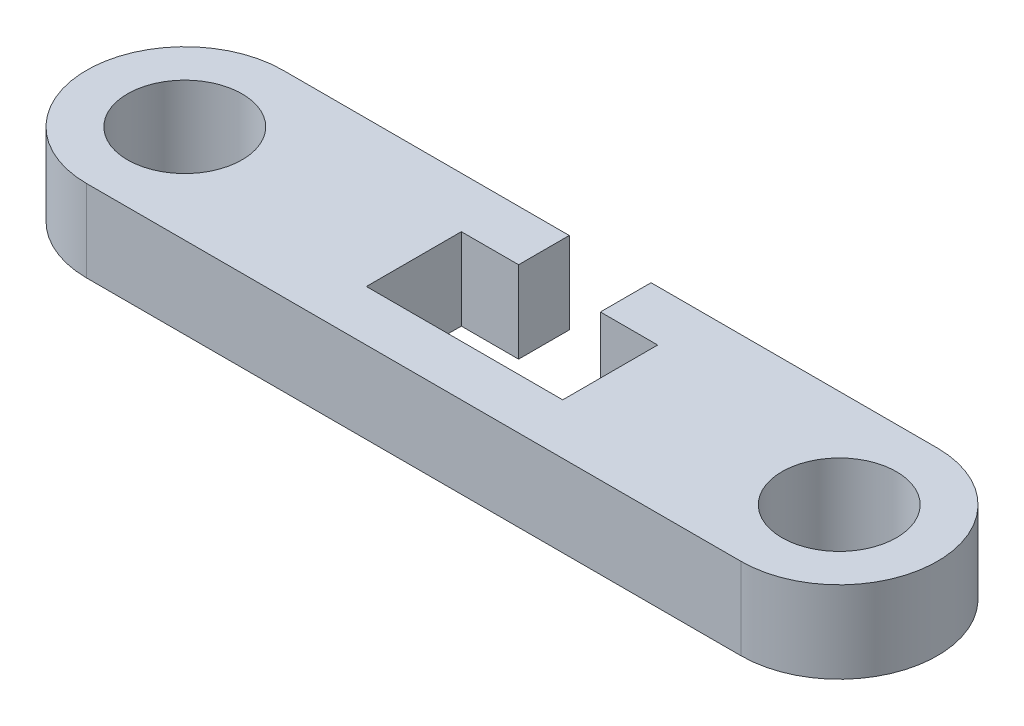
ISO-10303-21;
HEADER;
FILE_DESCRIPTION(('STEP AP214'),'2;1');
FILE_NAME('part.step','',(''),(''),'','','');
FILE_SCHEMA(('AUTOMOTIVE_DESIGN { 1 0 10303 214 1 1 1 1 }'));
ENDSEC;
DATA;
#1=APPLICATION_CONTEXT('core data for automotive mechanical design processes');
#2=APPLICATION_PROTOCOL_DEFINITION('international standard','automotive_design',2000,#1);
#3=PRODUCT_CONTEXT('',#1,'mechanical');
#4=PRODUCT('Part','Part','',(#3));
#5=PRODUCT_RELATED_PRODUCT_CATEGORY('part','',(#4));
#6=PRODUCT_DEFINITION_FORMATION('','',#4);
#7=PRODUCT_DEFINITION_CONTEXT('part definition',#1,'design');
#8=PRODUCT_DEFINITION('design','',#6,#7);
#9=PRODUCT_DEFINITION_SHAPE('','',#8);
#10=(LENGTH_UNIT() NAMED_UNIT(*) SI_UNIT(.MILLI.,.METRE.));
#11=(NAMED_UNIT(*) PLANE_ANGLE_UNIT() SI_UNIT($,.RADIAN.));
#12=(NAMED_UNIT(*) SI_UNIT($,.STERADIAN.) SOLID_ANGLE_UNIT());
#13=UNCERTAINTY_MEASURE_WITH_UNIT(LENGTH_MEASURE(1.E-05),#10,'distance_accuracy_value','');
#14=(GEOMETRIC_REPRESENTATION_CONTEXT(3) GLOBAL_UNCERTAINTY_ASSIGNED_CONTEXT((#13)) GLOBAL_UNIT_ASSIGNED_CONTEXT((#10,
#11,#12)) REPRESENTATION_CONTEXT('',''));
#15=CARTESIAN_POINT('',(0.,0.,0.));
#16=DIRECTION('',(0.,0.,1.));
#17=DIRECTION('',(1.,0.,0.));
#18=AXIS2_PLACEMENT_3D('',#15,#16,#17);
#19=CARTESIAN_POINT('',(4.75,2.5,0.));
#20=DIRECTION('',(1.,0.,0.));
#21=DIRECTION('',(0.,0.,-1.));
#22=AXIS2_PLACEMENT_3D('',#19,#20,#21);
#23=PLANE('',#22);
#24=DIRECTION('',(0.,0.,1.));
#25=VECTOR('',#24,1.);
#26=CARTESIAN_POINT('',(4.75,0.,0.));
#27=LINE('',#26,#25);
#28=CARTESIAN_POINT('',(4.75,0.,-5.));
#29=VERTEX_POINT('',#28);
#30=CARTESIAN_POINT('',(4.75,0.,-3.45180722891566));
#31=VERTEX_POINT('',#30);
#32=EDGE_CURVE('E187',#29,#31,#27,.T.);
#33=ORIENTED_EDGE('',*,*,#32,.T.);
#34=DIRECTION('',(0.,-1.,0.));
#35=VECTOR('',#34,1.);
#36=CARTESIAN_POINT('',(4.75,2.5,-3.45180722891566));
#37=LINE('',#36,#35);
#38=CARTESIAN_POINT('',(4.75,2.5,-3.45180722891566));
#39=VERTEX_POINT('',#38);
#40=EDGE_CURVE('E11',#39,#31,#37,.T.);
#41=ORIENTED_EDGE('',*,*,#40,.F.);
#42=DIRECTION('',(0.,0.,1.));
#43=VECTOR('',#42,1.);
#44=CARTESIAN_POINT('',(4.75,2.5,0.));
#45=LINE('',#44,#43);
#46=CARTESIAN_POINT('',(4.75,2.5,-5.));
#47=VERTEX_POINT('',#46);
#48=EDGE_CURVE('E232',#47,#39,#45,.T.);
#49=ORIENTED_EDGE('',*,*,#48,.F.);
#50=DIRECTION('',(0.,-1.,0.));
#51=VECTOR('',#50,1.);
#52=CARTESIAN_POINT('',(4.75,2.5,-5.));
#53=LINE('',#52,#51);
#54=EDGE_CURVE('E186',#47,#29,#53,.T.);
#55=ORIENTED_EDGE('',*,*,#54,.T.);
#56=EDGE_LOOP('',(#33,#41,#49,#55));
#57=FACE_BOUND('',#56,.T.);
#58=ADVANCED_FACE('F49',(#57),#23,.F.);
#59=CARTESIAN_POINT('',(0.,2.5,-3.45180722891566));
#60=DIRECTION('',(0.,0.,-1.));
#61=DIRECTION('',(-1.,0.,0.));
#62=AXIS2_PLACEMENT_3D('',#59,#60,#61);
#63=PLANE('',#62);
#64=DIRECTION('',(1.,0.,0.));
#65=VECTOR('',#64,1.);
#66=CARTESIAN_POINT('',(0.,0.,-3.45180722891566));
#67=LINE('',#66,#65);
#68=CARTESIAN_POINT('',(6.5,0.,-3.45180722891566));
#69=VERTEX_POINT('',#68);
#70=EDGE_CURVE('E191',#31,#69,#67,.T.);
#71=ORIENTED_EDGE('',*,*,#70,.T.);
#72=DIRECTION('',(0.,-1.,0.));
#73=VECTOR('',#72,1.);
#74=CARTESIAN_POINT('',(6.5,2.5,-3.45180722891566));
#75=LINE('',#74,#73);
#76=CARTESIAN_POINT('',(6.5,2.5,-3.45180722891566));
#77=VERTEX_POINT('',#76);
#78=EDGE_CURVE('E58',#77,#69,#75,.T.);
#79=ORIENTED_EDGE('',*,*,#78,.F.);
#80=DIRECTION('',(1.,0.,0.));
#81=VECTOR('',#80,1.);
#82=CARTESIAN_POINT('',(0.,2.5,-3.45180722891566));
#83=LINE('',#82,#81);
#84=EDGE_CURVE('E121',#39,#77,#83,.T.);
#85=ORIENTED_EDGE('',*,*,#84,.F.);
#86=ORIENTED_EDGE('',*,*,#40,.T.);
#87=EDGE_LOOP('',(#71,#79,#85,#86));
#88=FACE_BOUND('',#87,.T.);
#89=ADVANCED_FACE('F347',(#88),#63,.F.);
#90=CARTESIAN_POINT('',(6.5,2.5,0.));
#91=DIRECTION('',(1.,0.,0.));
#92=DIRECTION('',(0.,0.,-1.));
#93=AXIS2_PLACEMENT_3D('',#90,#91,#92);
#94=PLANE('',#93);
#95=DIRECTION('',(0.,0.,1.));
#96=VECTOR('',#95,1.);
#97=CARTESIAN_POINT('',(6.5,0.,0.));
#98=LINE('',#97,#96);
#99=CARTESIAN_POINT('',(6.5,0.,-0.55));
#100=VERTEX_POINT('',#99);
#101=EDGE_CURVE('E194',#69,#100,#98,.T.);
#102=ORIENTED_EDGE('',*,*,#101,.T.);
#103=DIRECTION('',(0.,-1.,0.));
#104=VECTOR('',#103,1.);
#105=CARTESIAN_POINT('',(6.5,2.5,-0.55));
#106=LINE('',#105,#104);
#107=CARTESIAN_POINT('',(6.5,2.5,-0.55));
#108=VERTEX_POINT('',#107);
#109=EDGE_CURVE('E255',#108,#100,#106,.T.);
#110=ORIENTED_EDGE('',*,*,#109,.F.);
#111=DIRECTION('',(0.,0.,1.));
#112=VECTOR('',#111,1.);
#113=CARTESIAN_POINT('',(6.5,2.5,0.));
#114=LINE('',#113,#112);
#115=EDGE_CURVE('E267',#77,#108,#114,.T.);
#116=ORIENTED_EDGE('',*,*,#115,.F.);
#117=ORIENTED_EDGE('',*,*,#78,.T.);
#118=EDGE_LOOP('',(#102,#110,#116,#117));
#119=FACE_BOUND('',#118,.T.);
#120=ADVANCED_FACE('F265',(#119),#94,.F.);
#121=CARTESIAN_POINT('',(0.,2.5,-0.549999999999999));
#122=DIRECTION('',(0.,0.,1.));
#123=DIRECTION('',(1.,0.,0.));
#124=AXIS2_PLACEMENT_3D('',#121,#122,#123);
#125=PLANE('',#124);
#126=DIRECTION('',(-1.,0.,0.));
#127=VECTOR('',#126,1.);
#128=CARTESIAN_POINT('',(0.,0.,-0.549999999999999));
#129=LINE('',#128,#127);
#130=CARTESIAN_POINT('',(0.5,0.,-0.549999999999999));
#131=VERTEX_POINT('',#130);
#132=EDGE_CURVE('E197',#100,#131,#129,.T.);
#133=ORIENTED_EDGE('',*,*,#132,.T.);
#134=DIRECTION('',(0.,-1.,0.));
#135=VECTOR('',#134,1.);
#136=CARTESIAN_POINT('',(0.5,2.5,-0.549999999999999));
#137=LINE('',#136,#135);
#138=CARTESIAN_POINT('',(0.5,2.5,-0.549999999999999));
#139=VERTEX_POINT('',#138);
#140=EDGE_CURVE('E251',#139,#131,#137,.T.);
#141=ORIENTED_EDGE('',*,*,#140,.F.);
#142=DIRECTION('',(-1.,0.,0.));
#143=VECTOR('',#142,1.);
#144=CARTESIAN_POINT('',(0.,2.5,-0.549999999999999));
#145=LINE('',#144,#143);
#146=EDGE_CURVE('E286',#108,#139,#145,.T.);
#147=ORIENTED_EDGE('',*,*,#146,.F.);
#148=ORIENTED_EDGE('',*,*,#109,.T.);
#149=EDGE_LOOP('',(#133,#141,#147,#148));
#150=FACE_BOUND('',#149,.T.);
#151=ADVANCED_FACE('F277',(#150),#125,.F.);
#152=CARTESIAN_POINT('',(0.5,2.5,0.));
#153=DIRECTION('',(-1.,0.,0.));
#154=DIRECTION('',(0.,0.,1.));
#155=AXIS2_PLACEMENT_3D('',#152,#153,#154);
#156=PLANE('',#155);
#157=DIRECTION('',(0.,0.,-1.));
#158=VECTOR('',#157,1.);
#159=CARTESIAN_POINT('',(0.5,0.,0.));
#160=LINE('',#159,#158);
#161=CARTESIAN_POINT('',(0.5,0.,-3.45180722891568));
#162=VERTEX_POINT('',#161);
#163=EDGE_CURVE('E200',#131,#162,#160,.T.);
#164=ORIENTED_EDGE('',*,*,#163,.T.);
#165=DIRECTION('',(0.,-1.,0.));
#166=VECTOR('',#165,1.);
#167=CARTESIAN_POINT('',(0.5,2.5,-3.45180722891568));
#168=LINE('',#167,#166);
#169=CARTESIAN_POINT('',(0.5,2.5,-3.45180722891568));
#170=VERTEX_POINT('',#169);
#171=EDGE_CURVE('E248',#170,#162,#168,.T.);
#172=ORIENTED_EDGE('',*,*,#171,.F.);
#173=DIRECTION('',(0.,0.,-1.));
#174=VECTOR('',#173,1.);
#175=CARTESIAN_POINT('',(0.5,2.5,0.));
#176=LINE('',#175,#174);
#177=EDGE_CURVE('E283',#139,#170,#176,.T.);
#178=ORIENTED_EDGE('',*,*,#177,.F.);
#179=ORIENTED_EDGE('',*,*,#140,.T.);
#180=EDGE_LOOP('',(#164,#172,#178,#179));
#181=FACE_BOUND('',#180,.T.);
#182=ADVANCED_FACE('F281',(#181),#156,.F.);
#183=CARTESIAN_POINT('',(0.,2.5,-3.45180722891568));
#184=DIRECTION('',(0.,0.,-1.));
#185=DIRECTION('',(-1.,0.,0.));
#186=AXIS2_PLACEMENT_3D('',#183,#184,#185);
#187=PLANE('',#186);
#188=DIRECTION('',(1.,0.,0.));
#189=VECTOR('',#188,1.);
#190=CARTESIAN_POINT('',(0.,0.,-3.45180722891568));
#191=LINE('',#190,#189);
#192=CARTESIAN_POINT('',(2.25,0.,-3.45180722891568));
#193=VERTEX_POINT('',#192);
#194=EDGE_CURVE('E203',#162,#193,#191,.T.);
#195=ORIENTED_EDGE('',*,*,#194,.T.);
#196=DIRECTION('',(0.,-1.,0.));
#197=VECTOR('',#196,1.);
#198=CARTESIAN_POINT('',(2.25,2.5,-3.45180722891568));
#199=LINE('',#198,#197);
#200=CARTESIAN_POINT('',(2.25,2.5,-3.45180722891568));
#201=VERTEX_POINT('',#200);
#202=EDGE_CURVE('E245',#201,#193,#199,.T.);
#203=ORIENTED_EDGE('',*,*,#202,.F.);
#204=DIRECTION('',(1.,0.,0.));
#205=VECTOR('',#204,1.);
#206=CARTESIAN_POINT('',(0.,2.5,-3.45180722891568));
#207=LINE('',#206,#205);
#208=EDGE_CURVE('E285',#170,#201,#207,.T.);
#209=ORIENTED_EDGE('',*,*,#208,.F.);
#210=ORIENTED_EDGE('',*,*,#171,.T.);
#211=EDGE_LOOP('',(#195,#203,#209,#210));
#212=FACE_BOUND('',#211,.T.);
#213=ADVANCED_FACE('F358',(#212),#187,.F.);
#214=CARTESIAN_POINT('',(2.25,2.5,0.));
#215=DIRECTION('',(1.,0.,0.));
#216=DIRECTION('',(0.,0.,-1.));
#217=AXIS2_PLACEMENT_3D('',#214,#215,#216);
#218=PLANE('',#217);
#219=DIRECTION('',(0.,0.,1.));
#220=VECTOR('',#219,1.);
#221=CARTESIAN_POINT('',(2.25,0.,0.));
#222=LINE('',#221,#220);
#223=CARTESIAN_POINT('',(2.25,0.,-5.));
#224=VERTEX_POINT('',#223);
#225=EDGE_CURVE('E207',#224,#193,#222,.T.);
#226=ORIENTED_EDGE('',*,*,#225,.F.);
#227=DIRECTION('',(0.,-1.,0.));
#228=VECTOR('',#227,1.);
#229=CARTESIAN_POINT('',(2.25,2.5,-5.));
#230=LINE('',#229,#228);
#231=CARTESIAN_POINT('',(2.25,2.5,-5.));
#232=VERTEX_POINT('',#231);
#233=EDGE_CURVE('E242',#232,#224,#230,.T.);
#234=ORIENTED_EDGE('',*,*,#233,.F.);
#235=DIRECTION('',(0.,0.,1.));
#236=VECTOR('',#235,1.);
#237=CARTESIAN_POINT('',(2.25,2.5,0.));
#238=LINE('',#237,#236);
#239=EDGE_CURVE('E291',#232,#201,#238,.T.);
#240=ORIENTED_EDGE('',*,*,#239,.T.);
#241=ORIENTED_EDGE('',*,*,#202,.T.);
#242=EDGE_LOOP('',(#226,#234,#240,#241));
#243=FACE_BOUND('',#242,.T.);
#244=ADVANCED_FACE('F361',(#243),#218,.T.);
#245=CARTESIAN_POINT('',(0.,2.5,-5.));
#246=DIRECTION('',(0.,0.,-1.));
#247=DIRECTION('',(-1.,0.,0.));
#248=AXIS2_PLACEMENT_3D('',#245,#246,#247);
#249=PLANE('',#248);
#250=DIRECTION('',(1.,0.,0.));
#251=VECTOR('',#250,1.);
#252=CARTESIAN_POINT('',(0.,0.,-5.));
#253=LINE('',#252,#251);
#254=CARTESIAN_POINT('',(-6.5,0.,-5.));
#255=VERTEX_POINT('',#254);
#256=EDGE_CURVE('E211',#255,#224,#253,.T.);
#257=ORIENTED_EDGE('',*,*,#256,.F.);
#258=DIRECTION('',(0.,-1.,0.));
#259=VECTOR('',#258,1.);
#260=CARTESIAN_POINT('',(-6.5,2.5,-5.));
#261=LINE('',#260,#259);
#262=CARTESIAN_POINT('',(-6.5,2.5,-5.));
#263=VERTEX_POINT('',#262);
#264=EDGE_CURVE('E239',#263,#255,#261,.T.);
#265=ORIENTED_EDGE('',*,*,#264,.F.);
#266=DIRECTION('',(1.,0.,0.));
#267=VECTOR('',#266,1.);
#268=CARTESIAN_POINT('',(0.,2.5,-5.));
#269=LINE('',#268,#267);
#270=EDGE_CURVE('E300',#263,#232,#269,.T.);
#271=ORIENTED_EDGE('',*,*,#270,.T.);
#272=ORIENTED_EDGE('',*,*,#233,.T.);
#273=EDGE_LOOP('',(#257,#265,#271,#272));
#274=FACE_BOUND('',#273,.T.);
#275=ADVANCED_FACE('F365',(#274),#249,.T.);
#276=CARTESIAN_POINT('',(-6.5,2.5,-2.));
#277=DIRECTION('',(0.,-1.,0.));
#278=DIRECTION('',(0.,0.,-1.));
#279=AXIS2_PLACEMENT_3D('',#276,#277,#278);
#280=CYLINDRICAL_SURFACE('',#279,3.);
#281=CARTESIAN_POINT('',(-6.5,0.,-2.));
#282=DIRECTION('',(0.,1.,0.));
#283=DIRECTION('',(0.,0.,1.));
#284=AXIS2_PLACEMENT_3D('',#281,#282,#283);
#285=CIRCLE('',#284,3.);
#286=CARTESIAN_POINT('',(-6.5,0.,1.));
#287=VERTEX_POINT('',#286);
#288=EDGE_CURVE('E215',#255,#287,#285,.T.);
#289=ORIENTED_EDGE('',*,*,#288,.T.);
#290=DIRECTION('',(0.,-1.,0.));
#291=VECTOR('',#290,1.);
#292=CARTESIAN_POINT('',(-6.5,2.5,1.));
#293=LINE('',#292,#291);
#294=CARTESIAN_POINT('',(-6.5,2.5,1.));
#295=VERTEX_POINT('',#294);
#296=EDGE_CURVE('E165',#295,#287,#293,.T.);
#297=ORIENTED_EDGE('',*,*,#296,.F.);
#298=CARTESIAN_POINT('',(-6.5,2.5,-2.));
#299=DIRECTION('',(0.,1.,0.));
#300=DIRECTION('',(0.,0.,1.));
#301=AXIS2_PLACEMENT_3D('',#298,#299,#300);
#302=CIRCLE('',#301,3.);
#303=EDGE_CURVE('E154',#263,#295,#302,.T.);
#304=ORIENTED_EDGE('',*,*,#303,.F.);
#305=ORIENTED_EDGE('',*,*,#264,.T.);
#306=EDGE_LOOP('',(#289,#297,#304,#305));
#307=FACE_BOUND('',#306,.T.);
#308=ADVANCED_FACE('F369',(#307),#280,.T.);
#309=CARTESIAN_POINT('',(0.,2.5,1.));
#310=DIRECTION('',(0.,0.,-1.));
#311=DIRECTION('',(-1.,0.,0.));
#312=AXIS2_PLACEMENT_3D('',#309,#310,#311);
#313=PLANE('',#312);
#314=DIRECTION('',(1.,0.,0.));
#315=VECTOR('',#314,1.);
#316=CARTESIAN_POINT('',(0.,0.,1.));
#317=LINE('',#316,#315);
#318=CARTESIAN_POINT('',(13.5,0.,1.));
#319=VERTEX_POINT('',#318);
#320=EDGE_CURVE('E163',#287,#319,#317,.T.);
#321=ORIENTED_EDGE('',*,*,#320,.T.);
#322=DIRECTION('',(0.,-1.,0.));
#323=VECTOR('',#322,1.);
#324=CARTESIAN_POINT('',(13.5,2.5,1.));
#325=LINE('',#324,#323);
#326=CARTESIAN_POINT('',(13.5,2.5,1.));
#327=VERTEX_POINT('',#326);
#328=EDGE_CURVE('E160',#327,#319,#325,.T.);
#329=ORIENTED_EDGE('',*,*,#328,.F.);
#330=DIRECTION('',(1.,0.,0.));
#331=VECTOR('',#330,1.);
#332=CARTESIAN_POINT('',(0.,2.5,1.));
#333=LINE('',#332,#331);
#334=EDGE_CURVE('E146',#295,#327,#333,.T.);
#335=ORIENTED_EDGE('',*,*,#334,.F.);
#336=ORIENTED_EDGE('',*,*,#296,.T.);
#337=EDGE_LOOP('',(#321,#329,#335,#336));
#338=FACE_BOUND('',#337,.T.);
#339=ADVANCED_FACE('F161',(#338),#313,.F.);
#340=CARTESIAN_POINT('',(13.5,2.5,-2.));
#341=DIRECTION('',(0.,-1.,0.));
#342=DIRECTION('',(0.,0.,-1.));
#343=AXIS2_PLACEMENT_3D('',#340,#341,#342);
#344=CYLINDRICAL_SURFACE('',#343,3.);
#345=CARTESIAN_POINT('',(13.5,0.,-2.));
#346=DIRECTION('',(0.,1.,0.));
#347=DIRECTION('',(0.,0.,1.));
#348=AXIS2_PLACEMENT_3D('',#345,#346,#347);
#349=CIRCLE('',#348,3.);
#350=CARTESIAN_POINT('',(13.5,0.,-5.));
#351=VERTEX_POINT('',#350);
#352=EDGE_CURVE('E107',#319,#351,#349,.T.);
#353=ORIENTED_EDGE('',*,*,#352,.T.);
#354=DIRECTION('',(0.,-1.,0.));
#355=VECTOR('',#354,1.);
#356=CARTESIAN_POINT('',(13.5,2.5,-5.));
#357=LINE('',#356,#355);
#358=CARTESIAN_POINT('',(13.5,2.5,-5.));
#359=VERTEX_POINT('',#358);
#360=EDGE_CURVE('E166',#359,#351,#357,.T.);
#361=ORIENTED_EDGE('',*,*,#360,.F.);
#362=CARTESIAN_POINT('',(13.5,2.5,-2.));
#363=DIRECTION('',(0.,1.,0.));
#364=DIRECTION('',(0.,0.,1.));
#365=AXIS2_PLACEMENT_3D('',#362,#363,#364);
#366=CIRCLE('',#365,3.);
#367=EDGE_CURVE('E151',#327,#359,#366,.T.);
#368=ORIENTED_EDGE('',*,*,#367,.F.);
#369=ORIENTED_EDGE('',*,*,#328,.T.);
#370=EDGE_LOOP('',(#353,#361,#368,#369));
#371=FACE_BOUND('',#370,.T.);
#372=ADVANCED_FACE('F168',(#371),#344,.T.);
#373=CARTESIAN_POINT('',(-6.5,2.5,-2.));
#374=DIRECTION('',(0.,-1.,0.));
#375=DIRECTION('',(0.,0.,-1.));
#376=AXIS2_PLACEMENT_3D('',#373,#374,#375);
#377=CYLINDRICAL_SURFACE('',#376,1.75);
#378=CARTESIAN_POINT('',(-6.5,2.5,-2.));
#379=DIRECTION('',(0.,1.,0.));
#380=DIRECTION('',(0.,0.,1.));
#381=AXIS2_PLACEMENT_3D('',#378,#379,#380);
#382=CIRCLE('',#381,1.75);
#383=CARTESIAN_POINT('',(-6.5,2.5,-0.25));
#384=VERTEX_POINT('',#383);
#385=EDGE_CURVE('E175',#384,#384,#382,.T.);
#386=ORIENTED_EDGE('',*,*,#385,.T.);
#387=EDGE_LOOP('',(#386));
#388=FACE_BOUND('',#387,.T.);
#389=CARTESIAN_POINT('',(-6.5,0.,-2.));
#390=DIRECTION('',(0.,1.,0.));
#391=DIRECTION('',(0.,0.,1.));
#392=AXIS2_PLACEMENT_3D('',#389,#390,#391);
#393=CIRCLE('',#392,1.75);
#394=CARTESIAN_POINT('',(-6.5,0.,-0.25));
#395=VERTEX_POINT('',#394);
#396=EDGE_CURVE('E224',#395,#395,#393,.T.);
#397=ORIENTED_EDGE('',*,*,#396,.F.);
#398=EDGE_LOOP('',(#397));
#399=FACE_BOUND('',#398,.T.);
#400=ADVANCED_FACE('F378',(#388,#399),#377,.F.);
#401=CARTESIAN_POINT('',(0.,2.5,-5.));
#402=DIRECTION('',(0.,0.,1.));
#403=DIRECTION('',(1.,0.,0.));
#404=AXIS2_PLACEMENT_3D('',#401,#402,#403);
#405=PLANE('',#404);
#406=DIRECTION('',(-1.,0.,0.));
#407=VECTOR('',#406,1.);
#408=CARTESIAN_POINT('',(0.,0.,-5.));
#409=LINE('',#408,#407);
#410=EDGE_CURVE('E113',#351,#29,#409,.T.);
#411=ORIENTED_EDGE('',*,*,#410,.T.);
#412=ORIENTED_EDGE('',*,*,#54,.F.);
#413=DIRECTION('',(-1.,0.,0.));
#414=VECTOR('',#413,1.);
#415=CARTESIAN_POINT('',(0.,2.5,-5.));
#416=LINE('',#415,#414);
#417=EDGE_CURVE('E66',#359,#47,#416,.T.);
#418=ORIENTED_EDGE('',*,*,#417,.F.);
#419=ORIENTED_EDGE('',*,*,#360,.T.);
#420=EDGE_LOOP('',(#411,#412,#418,#419));
#421=FACE_BOUND('',#420,.T.);
#422=ADVANCED_FACE('F379',(#421),#405,.F.);
#423=CARTESIAN_POINT('',(13.5,2.5,-2.));
#424=DIRECTION('',(0.,-1.,0.));
#425=DIRECTION('',(0.,0.,-1.));
#426=AXIS2_PLACEMENT_3D('',#423,#424,#425);
#427=CYLINDRICAL_SURFACE('',#426,1.75);
#428=CARTESIAN_POINT('',(13.5,2.5,-2.));
#429=DIRECTION('',(0.,1.,0.));
#430=DIRECTION('',(0.,0.,1.));
#431=AXIS2_PLACEMENT_3D('',#428,#429,#430);
#432=CIRCLE('',#431,1.75);
#433=CARTESIAN_POINT('',(13.5,2.5,-0.25));
#434=VERTEX_POINT('',#433);
#435=EDGE_CURVE('E182',#434,#434,#432,.T.);
#436=ORIENTED_EDGE('',*,*,#435,.T.);
#437=EDGE_LOOP('',(#436));
#438=FACE_BOUND('',#437,.T.);
#439=CARTESIAN_POINT('',(13.5,0.,-2.));
#440=DIRECTION('',(0.,1.,0.));
#441=DIRECTION('',(0.,0.,1.));
#442=AXIS2_PLACEMENT_3D('',#439,#440,#441);
#443=CIRCLE('',#442,1.75);
#444=CARTESIAN_POINT('',(13.5,0.,-0.25));
#445=VERTEX_POINT('',#444);
#446=EDGE_CURVE('E228',#445,#445,#443,.T.);
#447=ORIENTED_EDGE('',*,*,#446,.F.);
#448=EDGE_LOOP('',(#447));
#449=FACE_BOUND('',#448,.T.);
#450=ADVANCED_FACE('F382',(#438,#449),#427,.F.);
#451=CARTESIAN_POINT('',(0.,2.5,0.));
#452=DIRECTION('',(0.,1.,0.));
#453=DIRECTION('',(0.,0.,1.));
#454=AXIS2_PLACEMENT_3D('',#451,#452,#453);
#455=PLANE('',#454);
#456=ORIENTED_EDGE('',*,*,#48,.T.);
#457=ORIENTED_EDGE('',*,*,#84,.T.);
#458=ORIENTED_EDGE('',*,*,#115,.T.);
#459=ORIENTED_EDGE('',*,*,#146,.T.);
#460=ORIENTED_EDGE('',*,*,#177,.T.);
#461=ORIENTED_EDGE('',*,*,#208,.T.);
#462=ORIENTED_EDGE('',*,*,#239,.F.);
#463=ORIENTED_EDGE('',*,*,#270,.F.);
#464=ORIENTED_EDGE('',*,*,#303,.T.);
#465=ORIENTED_EDGE('',*,*,#334,.T.);
#466=ORIENTED_EDGE('',*,*,#367,.T.);
#467=ORIENTED_EDGE('',*,*,#417,.T.);
#468=EDGE_LOOP('',(#456,#457,#458,#459,#460,#461,#462,#463,#464,#465,#466,#467));
#469=FACE_BOUND('',#468,.T.);
#470=ORIENTED_EDGE('',*,*,#385,.F.);
#471=EDGE_LOOP('',(#470));
#472=FACE_BOUND('',#471,.T.);
#473=ORIENTED_EDGE('',*,*,#435,.F.);
#474=EDGE_LOOP('',(#473));
#475=FACE_BOUND('',#474,.T.);
#476=ADVANCED_FACE('F148',(#469,#472,#475),#455,.T.);
#477=CARTESIAN_POINT('',(0.,0.,0.));
#478=DIRECTION('',(0.,1.,0.));
#479=DIRECTION('',(0.,0.,1.));
#480=AXIS2_PLACEMENT_3D('',#477,#478,#479);
#481=PLANE('',#480);
#482=ORIENTED_EDGE('',*,*,#32,.F.);
#483=ORIENTED_EDGE('',*,*,#410,.F.);
#484=ORIENTED_EDGE('',*,*,#352,.F.);
#485=ORIENTED_EDGE('',*,*,#320,.F.);
#486=ORIENTED_EDGE('',*,*,#288,.F.);
#487=ORIENTED_EDGE('',*,*,#256,.T.);
#488=ORIENTED_EDGE('',*,*,#225,.T.);
#489=ORIENTED_EDGE('',*,*,#194,.F.);
#490=ORIENTED_EDGE('',*,*,#163,.F.);
#491=ORIENTED_EDGE('',*,*,#132,.F.);
#492=ORIENTED_EDGE('',*,*,#101,.F.);
#493=ORIENTED_EDGE('',*,*,#70,.F.);
#494=EDGE_LOOP('',(#482,#483,#484,#485,#486,#487,#488,#489,#490,#491,#492,#493));
#495=FACE_BOUND('',#494,.T.);
#496=ORIENTED_EDGE('',*,*,#396,.T.);
#497=EDGE_LOOP('',(#496));
#498=FACE_BOUND('',#497,.T.);
#499=ORIENTED_EDGE('',*,*,#446,.T.);
#500=EDGE_LOOP('',(#499));
#501=FACE_BOUND('',#500,.T.);
#502=ADVANCED_FACE('F271',(#495,#498,#501),#481,.F.);
#503=CLOSED_SHELL('',(#58,#89,#120,#151,#182,#213,#244,#275,#308,#339,#372,#400,#422,#450,#476,#502));
#504=MANIFOLD_SOLID_BREP('B2',#503);
#505=ADVANCED_BREP_SHAPE_REPRESENTATION('',(#18,#504),#14);
#506=SHAPE_DEFINITION_REPRESENTATION(#9,#505);
ENDSEC;
END-ISO-10303-21;
